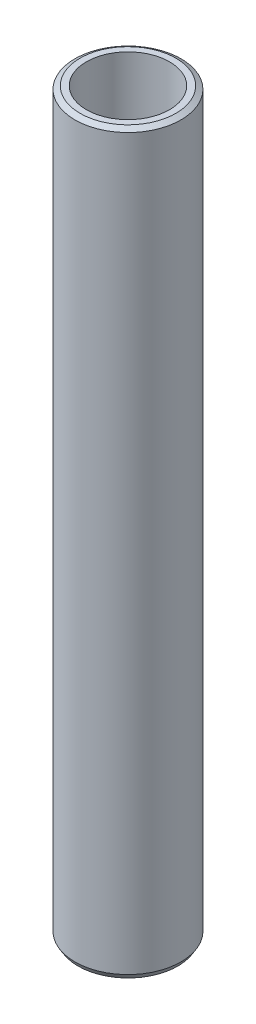
ISO-10303-21;
HEADER;
FILE_DESCRIPTION(('STEP AP214'),'2;1');
FILE_NAME('part.step','',(''),(''),'','','');
FILE_SCHEMA(('AUTOMOTIVE_DESIGN { 1 0 10303 214 1 1 1 1 }'));
ENDSEC;
DATA;
#1=APPLICATION_CONTEXT('core data for automotive mechanical design processes');
#2=APPLICATION_PROTOCOL_DEFINITION('international standard','automotive_design',2000,#1);
#3=PRODUCT_CONTEXT('',#1,'mechanical');
#4=PRODUCT('Part','Part','',(#3));
#5=PRODUCT_RELATED_PRODUCT_CATEGORY('part','',(#4));
#6=PRODUCT_DEFINITION_FORMATION('','',#4);
#7=PRODUCT_DEFINITION_CONTEXT('part definition',#1,'design');
#8=PRODUCT_DEFINITION('design','',#6,#7);
#9=PRODUCT_DEFINITION_SHAPE('','',#8);
#10=(LENGTH_UNIT() NAMED_UNIT(*) SI_UNIT(.MILLI.,.METRE.));
#11=(NAMED_UNIT(*) PLANE_ANGLE_UNIT() SI_UNIT($,.RADIAN.));
#12=(NAMED_UNIT(*) SI_UNIT($,.STERADIAN.) SOLID_ANGLE_UNIT());
#13=UNCERTAINTY_MEASURE_WITH_UNIT(LENGTH_MEASURE(1.E-05),#10,'distance_accuracy_value','');
#14=(GEOMETRIC_REPRESENTATION_CONTEXT(3) GLOBAL_UNCERTAINTY_ASSIGNED_CONTEXT((#13)) GLOBAL_UNIT_ASSIGNED_CONTEXT((#10,
#11,#12)) REPRESENTATION_CONTEXT('',''));
#15=CARTESIAN_POINT('',(0.,0.,0.));
#16=DIRECTION('',(0.,0.,1.));
#17=DIRECTION('',(1.,0.,0.));
#18=AXIS2_PLACEMENT_3D('',#15,#16,#17);
#19=CARTESIAN_POINT('',(0.,521.538332557431,0.));
#20=DIRECTION('',(0.,-1.,0.));
#21=DIRECTION('',(0.,0.,-1.));
#22=AXIS2_PLACEMENT_3D('',#19,#20,#21);
#23=CYLINDRICAL_SURFACE('',#22,37.5);
#24=CARTESIAN_POINT('',(0.,519.368557003076,0.));
#25=DIRECTION('',(0.,1.,0.));
#26=DIRECTION('',(0.,0.,1.));
#27=AXIS2_PLACEMENT_3D('',#24,#25,#26);
#28=CIRCLE('',#27,37.5);
#29=CARTESIAN_POINT('',(0.,519.368557003076,37.5));
#30=VERTEX_POINT('',#29);
#31=EDGE_CURVE('E50',#30,#30,#28,.F.);
#32=ORIENTED_EDGE('',*,*,#31,.T.);
#33=EDGE_LOOP('',(#32));
#34=FACE_BOUND('',#33,.T.);
#35=CARTESIAN_POINT('',(0.,3.6321108297086,0.));
#36=DIRECTION('',(0.,1.,0.));
#37=DIRECTION('',(0.,0.,1.));
#38=AXIS2_PLACEMENT_3D('',#35,#36,#37);
#39=CIRCLE('',#38,37.5);
#40=CARTESIAN_POINT('',(0.,3.6321108297086,37.5));
#41=VERTEX_POINT('',#40);
#42=EDGE_CURVE('E51',#41,#41,#39,.T.);
#43=ORIENTED_EDGE('',*,*,#42,.T.);
#44=EDGE_LOOP('',(#43));
#45=FACE_BOUND('',#44,.T.);
#46=ADVANCED_FACE('F39',(#34,#45),#23,.T.);
#47=CARTESIAN_POINT('',(0.,521.538332557431,0.));
#48=DIRECTION('',(0.,1.,0.));
#49=DIRECTION('',(0.,0.,1.));
#50=AXIS2_PLACEMENT_3D('',#47,#48,#49);
#51=PLANE('',#50);
#52=CARTESIAN_POINT('',(0.,521.538332557431,0.));
#53=DIRECTION('',(0.,1.,0.));
#54=DIRECTION('',(0.,0.,1.));
#55=AXIS2_PLACEMENT_3D('',#52,#53,#54);
#56=CIRCLE('',#55,33.8678891702913);
#57=CARTESIAN_POINT('',(0.,521.538332557431,33.8678891702913));
#58=VERTEX_POINT('',#57);
#59=EDGE_CURVE('E54',#58,#58,#56,.T.);
#60=ORIENTED_EDGE('',*,*,#59,.T.);
#61=EDGE_LOOP('',(#60));
#62=FACE_BOUND('',#61,.T.);
#63=CARTESIAN_POINT('',(0.,521.538332557431,0.));
#64=DIRECTION('',(0.,1.,0.));
#65=DIRECTION('',(0.,0.,1.));
#66=AXIS2_PLACEMENT_3D('',#63,#64,#65);
#67=CIRCLE('',#66,29.3926829674131);
#68=CARTESIAN_POINT('',(0.,521.538332557431,29.3926829674131));
#69=VERTEX_POINT('',#68);
#70=EDGE_CURVE('E58',#69,#69,#67,.T.);
#71=ORIENTED_EDGE('',*,*,#70,.F.);
#72=EDGE_LOOP('',(#71));
#73=FACE_BOUND('',#72,.T.);
#74=ADVANCED_FACE('F69',(#62,#73),#51,.T.);
#75=CARTESIAN_POINT('',(0.,0.,0.));
#76=DIRECTION('',(0.,1.,0.));
#77=DIRECTION('',(0.,0.,1.));
#78=AXIS2_PLACEMENT_3D('',#75,#76,#77);
#79=PLANE('',#78);
#80=CARTESIAN_POINT('',(0.,0.,0.));
#81=DIRECTION('',(0.,1.,0.));
#82=DIRECTION('',(0.,0.,1.));
#83=AXIS2_PLACEMENT_3D('',#80,#81,#82);
#84=CIRCLE('',#83,35.330224445646);
#85=CARTESIAN_POINT('',(0.,0.,35.330224445646));
#86=VERTEX_POINT('',#85);
#87=EDGE_CURVE('E10',#86,#86,#84,.F.);
#88=ORIENTED_EDGE('',*,*,#87,.T.);
#89=EDGE_LOOP('',(#88));
#90=FACE_BOUND('',#89,.T.);
#91=CARTESIAN_POINT('',(0.,0.,0.));
#92=DIRECTION('',(0.,1.,0.));
#93=DIRECTION('',(0.,0.,1.));
#94=AXIS2_PLACEMENT_3D('',#91,#92,#93);
#95=CIRCLE('',#94,29.3926829674131);
#96=CARTESIAN_POINT('',(0.,0.,29.3926829674131));
#97=VERTEX_POINT('',#96);
#98=EDGE_CURVE('E63',#97,#97,#95,.T.);
#99=ORIENTED_EDGE('',*,*,#98,.T.);
#100=EDGE_LOOP('',(#99));
#101=FACE_BOUND('',#100,.T.);
#102=ADVANCED_FACE('F75',(#90,#101),#79,.F.);
#103=CARTESIAN_POINT('',(0.,521.538332557431,0.));
#104=DIRECTION('',(0.,-1.,0.));
#105=DIRECTION('',(0.,0.,-1.));
#106=AXIS2_PLACEMENT_3D('',#103,#104,#105);
#107=CYLINDRICAL_SURFACE('',#106,29.3926829674131);
#108=ORIENTED_EDGE('',*,*,#70,.T.);
#109=EDGE_LOOP('',(#108));
#110=FACE_BOUND('',#109,.T.);
#111=ORIENTED_EDGE('',*,*,#98,.F.);
#112=EDGE_LOOP('',(#111));
#113=FACE_BOUND('',#112,.T.);
#114=ADVANCED_FACE('F70',(#110,#113),#107,.F.);
#115=CARTESIAN_POINT('',(0.,521.538332557431,0.));
#116=DIRECTION('',(0.,-1.,0.));
#117=DIRECTION('',(0.,0.,-1.));
#118=AXIS2_PLACEMENT_3D('',#115,#116,#117);
#119=CONICAL_SURFACE('',#118,33.8678891702913,1.03230041339479);
#120=ORIENTED_EDGE('',*,*,#31,.F.);
#121=EDGE_LOOP('',(#120));
#122=FACE_BOUND('',#121,.T.);
#123=ORIENTED_EDGE('',*,*,#59,.F.);
#124=EDGE_LOOP('',(#123));
#125=FACE_BOUND('',#124,.T.);
#126=ADVANCED_FACE('F81',(#122,#125),#119,.T.);
#127=CARTESIAN_POINT('',(0.,3.6321108297086,0.));
#128=DIRECTION('',(0.,1.,0.));
#129=DIRECTION('',(0.,0.,1.));
#130=AXIS2_PLACEMENT_3D('',#127,#128,#129);
#131=CONICAL_SURFACE('',#130,37.5,0.53849591340012);
#132=CARTESIAN_POINT('',(0.,0.,35.330224445646));
#133=CARTESIAN_POINT('',(0.,0.0378344878094658,35.3528262743371));
#134=CARTESIAN_POINT('',(0.,0.0756689756189299,35.3754281030283));
#135=CARTESIAN_POINT('',(0.,0.151337951237858,35.4206317604107));
#136=CARTESIAN_POINT('',(0.,0.189172439047322,35.4432335891019));
#137=CARTESIAN_POINT('',(0.,0.264841414666251,35.4884372464843));
#138=CARTESIAN_POINT('',(0.,0.302675902475717,35.5110390751755));
#139=CARTESIAN_POINT('',(0.,0.378344878094646,35.5562427325578));
#140=CARTESIAN_POINT('',(0.,0.41617936590411,35.578844561249));
#141=CARTESIAN_POINT('',(0.,0.491848341523039,35.6240482186314));
#142=CARTESIAN_POINT('',(0.,0.529682829332504,35.6466500473226));
#143=CARTESIAN_POINT('',(0.,0.605351804951434,35.691853704705));
#144=CARTESIAN_POINT('',(0.,0.643186292760897,35.7144555333962));
#145=CARTESIAN_POINT('',(0.,0.718855268379826,35.7596591907785));
#146=CARTESIAN_POINT('',(0.,0.756689756189292,35.7822610194697));
#147=CARTESIAN_POINT('',(0.,0.832358731808221,35.8274646768521));
#148=CARTESIAN_POINT('',(0.,0.870193219617685,35.8500665055433));
#149=CARTESIAN_POINT('',(0.,0.945862195236614,35.8952701629257));
#150=CARTESIAN_POINT('',(0.,0.98369668304608,35.9178719916168));
#151=CARTESIAN_POINT('',(0.,1.05936565866501,35.9630756489992));
#152=CARTESIAN_POINT('',(0.,1.09720014647447,35.9856774776904));
#153=CARTESIAN_POINT('',(0.,1.1728691220934,36.0308811350728));
#154=CARTESIAN_POINT('',(0.,1.21070360990287,36.053482963764));
#155=CARTESIAN_POINT('',(0.,1.2863725855218,36.0986866211463));
#156=CARTESIAN_POINT('',(0.,1.32420707333126,36.1212884498375));
#157=CARTESIAN_POINT('',(0.,1.39987604895019,36.1664921072199));
#158=CARTESIAN_POINT('',(0.,1.43771053675965,36.1890939359111));
#159=CARTESIAN_POINT('',(0.,1.51337951237858,36.2342975932935));
#160=CARTESIAN_POINT('',(0.,1.55121400018805,36.2568994219847));
#161=CARTESIAN_POINT('',(0.,1.62688297580698,36.302103079367));
#162=CARTESIAN_POINT('',(0.,1.66471746361644,36.3247049080582));
#163=CARTESIAN_POINT('',(0.,1.74038643923537,36.3699085654406));
#164=CARTESIAN_POINT('',(0.,1.77822092704484,36.3925103941318));
#165=CARTESIAN_POINT('',(0.,1.85388990266376,36.4377140515142));
#166=CARTESIAN_POINT('',(0.,1.89172439047323,36.4603158802053));
#167=CARTESIAN_POINT('',(0.,1.96739336609216,36.5055195375877));
#168=CARTESIAN_POINT('',(0.,2.00522785390162,36.5281213662789));
#169=CARTESIAN_POINT('',(0.,2.08089682952055,36.5733250236613));
#170=CARTESIAN_POINT('',(0.,2.11873131733002,36.5959268523525));
#171=CARTESIAN_POINT('',(0.,2.19440029294895,36.6411305097349));
#172=CARTESIAN_POINT('',(0.,2.23223478075841,36.6637323384261));
#173=CARTESIAN_POINT('',(0.,2.30790375637734,36.7089359958084));
#174=CARTESIAN_POINT('',(0.,2.34573824418681,36.7315378244996));
#175=CARTESIAN_POINT('',(0.,2.42140721980573,36.776741481882));
#176=CARTESIAN_POINT('',(0.,2.4592417076152,36.7993433105732));
#177=CARTESIAN_POINT('',(0.,2.53491068323413,36.8445469679556));
#178=CARTESIAN_POINT('',(0.,2.57274517104359,36.8671487966467));
#179=CARTESIAN_POINT('',(0.,2.64841414666252,36.9123524540291));
#180=CARTESIAN_POINT('',(0.,2.68624863447199,36.9349542827203));
#181=CARTESIAN_POINT('',(0.,2.76191761009091,36.9801579401027));
#182=CARTESIAN_POINT('',(0.,2.79975209790038,37.0027597687939));
#183=CARTESIAN_POINT('',(0.,2.87542107351931,37.0479634261762));
#184=CARTESIAN_POINT('',(0.,2.91325556132877,37.0705652548674));
#185=CARTESIAN_POINT('',(0.,2.9889245369477,37.1157689122498));
#186=CARTESIAN_POINT('',(0.,3.02675902475717,37.138370740941));
#187=CARTESIAN_POINT('',(0.,3.1024280003761,37.1835743983234));
#188=CARTESIAN_POINT('',(0.,3.14026248818556,37.2061762270146));
#189=CARTESIAN_POINT('',(0.,3.21593146380449,37.2513798843969));
#190=CARTESIAN_POINT('',(0.,3.25376595161396,37.2739817130881));
#191=CARTESIAN_POINT('',(0.,3.32943492723288,37.3191853704705));
#192=CARTESIAN_POINT('',(0.,3.36726941504235,37.3417871991617));
#193=CARTESIAN_POINT('',(0.,3.44293839066128,37.3869908565441));
#194=CARTESIAN_POINT('',(0.,3.48077287847074,37.4095926852352));
#195=CARTESIAN_POINT('',(0.,3.55644185408967,37.4547963426176));
#196=CARTESIAN_POINT('',(0.,3.59427634189914,37.4773981713088));
#197=CARTESIAN_POINT('',(0.,3.6321108297086,37.5));
#198=B_SPLINE_CURVE_WITH_KNOTS('',3,(#132,#133,#134,#135,#136,#137,#138,#139,#140,#141,#142,
#143,#144,#145,#146,#147,#148,#149,#150,#151,#152,#153,#154,#155,#156,#157,#158,#159,#160,#161,
#162,#163,#164,#165,#166,#167,#168,#169,#170,#171,#172,#173,#174,#175,#176,#177,#178,#179,#180,
#181,#182,#183,#184,#185,#186,#187,#188,#189,#190,#191,#192,#193,#194,#195,#196,#197),
.UNSPECIFIED.,.F.,.F.,(4,2,2,2,2,2,2,2,2,2,2,2,2,2,2,2,2,2,2,2,2,2,2,2,2,2,2,2,2,2,2,2,4),(0.,
0.132214296321966,0.264428592643935,0.3966428889659,0.52885718528787,0.661071481609835,
0.793285777931805,0.92550007425377,1.05771437057574,1.1899286668977,1.32214296321967,
1.45435725954164,1.58657155586361,1.71878585218557,1.85100014850754,1.98321444482951,
2.11542874115148,2.24764303747344,2.37985733379541,2.51207163011738,2.64428592643935,
2.77650022276131,2.90871451908328,3.04092881540525,3.17314311172722,3.30535740804918,
3.43757170437115,3.56978600069312,3.70200029701509,3.83421459333705,3.96642888965902,
4.09864318598099,4.23085748230296),.UNSPECIFIED.);
#199=EDGE_CURVE('BSEAM45',#86,#41,#198,.T.);
#200=ORIENTED_EDGE('',*,*,#87,.F.);
#201=ORIENTED_EDGE('',*,*,#42,.F.);
#202=ORIENTED_EDGE('',*,*,#199,.T.);
#203=ORIENTED_EDGE('',*,*,#199,.F.);
#204=EDGE_LOOP('',(#200,#202,#201,#203));
#205=FACE_BOUND('',#204,.T.);
#206=ADVANCED_FACE('F45',(#205),#131,.T.);
#207=CLOSED_SHELL('',(#46,#74,#102,#114,#126,#206));
#208=MANIFOLD_SOLID_BREP('B2',#207);
#209=ADVANCED_BREP_SHAPE_REPRESENTATION('',(#18,#208),#14);
#210=SHAPE_DEFINITION_REPRESENTATION(#9,#209);
ENDSEC;
END-ISO-10303-21;
